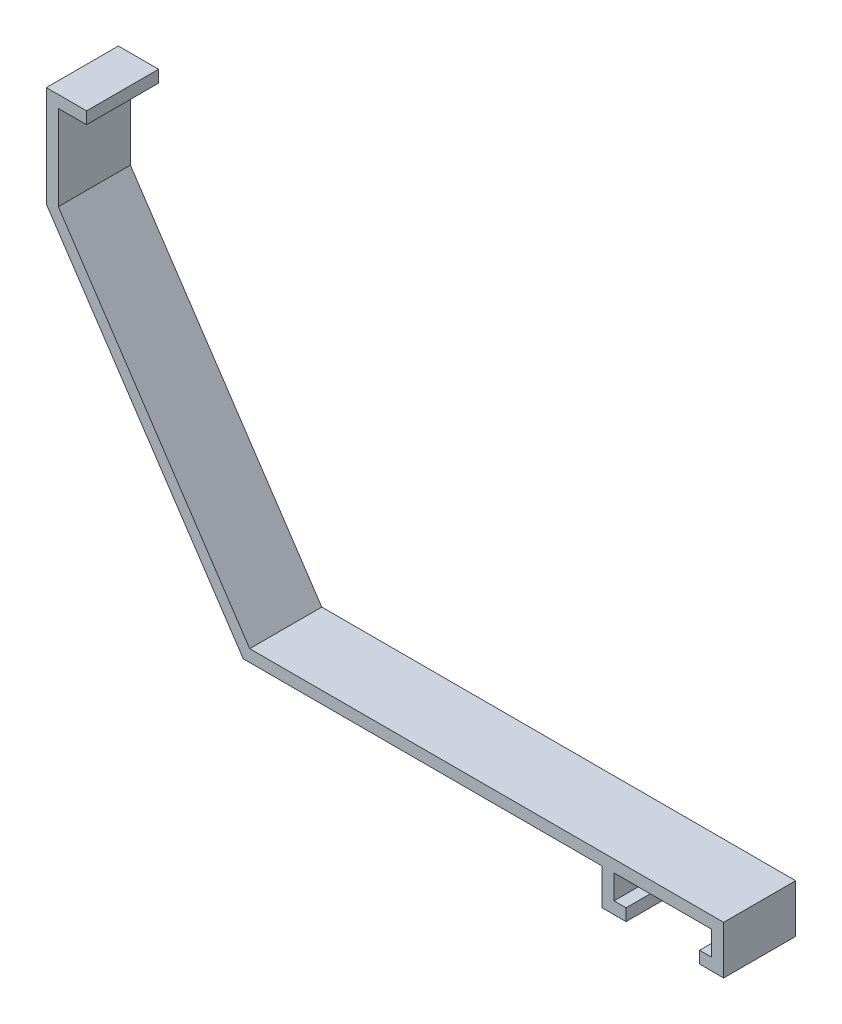
ISO-10303-21;
HEADER;
FILE_DESCRIPTION(('STEP AP214'),'2;1');
FILE_NAME('part.step','',(''),(''),'','','');
FILE_SCHEMA(('AUTOMOTIVE_DESIGN { 1 0 10303 214 1 1 1 1 }'));
ENDSEC;
DATA;
#1=APPLICATION_CONTEXT('core data for automotive mechanical design processes');
#2=APPLICATION_PROTOCOL_DEFINITION('international standard','automotive_design',2000,#1);
#3=PRODUCT_CONTEXT('',#1,'mechanical');
#4=PRODUCT('Part','Part','',(#3));
#5=PRODUCT_RELATED_PRODUCT_CATEGORY('part','',(#4));
#6=PRODUCT_DEFINITION_FORMATION('','',#4);
#7=PRODUCT_DEFINITION_CONTEXT('part definition',#1,'design');
#8=PRODUCT_DEFINITION('design','',#6,#7);
#9=PRODUCT_DEFINITION_SHAPE('','',#8);
#10=(LENGTH_UNIT() NAMED_UNIT(*) SI_UNIT(.MILLI.,.METRE.));
#11=(NAMED_UNIT(*) PLANE_ANGLE_UNIT() SI_UNIT($,.RADIAN.));
#12=(NAMED_UNIT(*) SI_UNIT($,.STERADIAN.) SOLID_ANGLE_UNIT());
#13=UNCERTAINTY_MEASURE_WITH_UNIT(LENGTH_MEASURE(1.E-05),#10,'distance_accuracy_value','');
#14=(GEOMETRIC_REPRESENTATION_CONTEXT(3) GLOBAL_UNCERTAINTY_ASSIGNED_CONTEXT((#13)) GLOBAL_UNIT_ASSIGNED_CONTEXT((#10,
#11,#12)) REPRESENTATION_CONTEXT('',''));
#15=CARTESIAN_POINT('',(0.,0.,0.));
#16=DIRECTION('',(0.,0.,1.));
#17=DIRECTION('',(1.,0.,0.));
#18=AXIS2_PLACEMENT_3D('',#15,#16,#17);
#19=CARTESIAN_POINT('',(0.,-1.5875,9.525));
#20=DIRECTION('',(-1.,0.,0.));
#21=DIRECTION('',(0.,0.,1.));
#22=AXIS2_PLACEMENT_3D('',#19,#20,#21);
#23=PLANE('',#22);
#24=DIRECTION('',(0.,1.,0.));
#25=VECTOR('',#24,1.);
#26=CARTESIAN_POINT('',(0.,-1.5875,0.));
#27=LINE('',#26,#25);
#28=CARTESIAN_POINT('',(0.,-1.5875,0.));
#29=VERTEX_POINT('',#28);
#30=CARTESIAN_POINT('',(0.,0.,0.));
#31=VERTEX_POINT('',#30);
#32=EDGE_CURVE('E203',#29,#31,#27,.T.);
#33=ORIENTED_EDGE('',*,*,#32,.T.);
#34=DIRECTION('',(0.,0.,-1.));
#35=VECTOR('',#34,1.);
#36=CARTESIAN_POINT('',(0.,0.,9.525));
#37=LINE('',#36,#35);
#38=CARTESIAN_POINT('',(0.,0.,9.525));
#39=VERTEX_POINT('',#38);
#40=EDGE_CURVE('E11',#39,#31,#37,.T.);
#41=ORIENTED_EDGE('',*,*,#40,.F.);
#42=DIRECTION('',(0.,1.,0.));
#43=VECTOR('',#42,1.);
#44=CARTESIAN_POINT('',(0.,-1.5875,9.525));
#45=LINE('',#44,#43);
#46=CARTESIAN_POINT('',(0.,-1.5875,9.525));
#47=VERTEX_POINT('',#46);
#48=EDGE_CURVE('E241',#47,#39,#45,.T.);
#49=ORIENTED_EDGE('',*,*,#48,.F.);
#50=DIRECTION('',(0.,0.,-1.));
#51=VECTOR('',#50,1.);
#52=CARTESIAN_POINT('',(0.,-1.5875,9.525));
#53=LINE('',#52,#51);
#54=EDGE_CURVE('E199',#47,#29,#53,.T.);
#55=ORIENTED_EDGE('',*,*,#54,.T.);
#56=EDGE_LOOP('',(#33,#41,#49,#55));
#57=FACE_BOUND('',#56,.T.);
#58=ADVANCED_FACE('F35',(#57),#23,.F.);
#59=CARTESIAN_POINT('',(0.,0.,9.525));
#60=DIRECTION('',(0.,-1.,0.));
#61=DIRECTION('',(1.,0.,0.));
#62=AXIS2_PLACEMENT_3D('',#59,#60,#61);
#63=PLANE('',#62);
#64=DIRECTION('',(-1.,0.,0.));
#65=VECTOR('',#64,1.);
#66=CARTESIAN_POINT('',(0.,0.,0.));
#67=LINE('',#66,#65);
#68=CARTESIAN_POINT('',(-5.3213,0.,0.));
#69=VERTEX_POINT('',#68);
#70=EDGE_CURVE('E206',#31,#69,#67,.T.);
#71=ORIENTED_EDGE('',*,*,#70,.T.);
#72=DIRECTION('',(0.,0.,-1.));
#73=VECTOR('',#72,1.);
#74=CARTESIAN_POINT('',(-5.3213,0.,9.525));
#75=LINE('',#74,#73);
#76=CARTESIAN_POINT('',(-5.3213,0.,9.525));
#77=VERTEX_POINT('',#76);
#78=EDGE_CURVE('E43',#77,#69,#75,.T.);
#79=ORIENTED_EDGE('',*,*,#78,.F.);
#80=DIRECTION('',(-1.,0.,0.));
#81=VECTOR('',#80,1.);
#82=CARTESIAN_POINT('',(0.,0.,9.525));
#83=LINE('',#82,#81);
#84=EDGE_CURVE('E130',#39,#77,#83,.T.);
#85=ORIENTED_EDGE('',*,*,#84,.F.);
#86=ORIENTED_EDGE('',*,*,#40,.T.);
#87=EDGE_LOOP('',(#71,#79,#85,#86));
#88=FACE_BOUND('',#87,.T.);
#89=ADVANCED_FACE('F359',(#88),#63,.F.);
#90=CARTESIAN_POINT('',(-5.3213,0.,9.525));
#91=DIRECTION('',(1.,0.,0.));
#92=DIRECTION('',(0.,1.,0.));
#93=AXIS2_PLACEMENT_3D('',#90,#91,#92);
#94=PLANE('',#93);
#95=DIRECTION('',(0.,-1.,0.));
#96=VECTOR('',#95,1.);
#97=CARTESIAN_POINT('',(-5.3213,0.,0.));
#98=LINE('',#97,#96);
#99=CARTESIAN_POINT('',(-5.3213,-13.3191597256673,0.));
#100=VERTEX_POINT('',#99);
#101=EDGE_CURVE('E208',#69,#100,#98,.T.);
#102=ORIENTED_EDGE('',*,*,#101,.T.);
#103=DIRECTION('',(0.,0.,-1.));
#104=VECTOR('',#103,1.);
#105=CARTESIAN_POINT('',(-5.3213,-13.3191597256673,9.525));
#106=LINE('',#105,#104);
#107=CARTESIAN_POINT('',(-5.3213,-13.3191597256673,9.525));
#108=VERTEX_POINT('',#107);
#109=EDGE_CURVE('E284',#108,#100,#106,.T.);
#110=ORIENTED_EDGE('',*,*,#109,.F.);
#111=DIRECTION('',(0.,-1.,0.));
#112=VECTOR('',#111,1.);
#113=CARTESIAN_POINT('',(-5.3213,0.,9.525));
#114=LINE('',#113,#112);
#115=EDGE_CURVE('E292',#77,#108,#114,.T.);
#116=ORIENTED_EDGE('',*,*,#115,.F.);
#117=ORIENTED_EDGE('',*,*,#78,.T.);
#118=EDGE_LOOP('',(#102,#110,#116,#117));
#119=FACE_BOUND('',#118,.T.);
#120=ADVANCED_FACE('F290',(#119),#94,.F.);
#121=CARTESIAN_POINT('',(-5.3213,-13.3191597256673,9.525));
#122=DIRECTION('',(0.832050948079559,0.554699215611404,0.));
#123=DIRECTION('',(-0.554699215611404,0.832050948079559,0.));
#124=AXIS2_PLACEMENT_3D('',#121,#122,#123);
#125=PLANE('',#124);
#126=DIRECTION('',(0.554699215611404,-0.832050948079559,0.));
#127=VECTOR('',#126,1.);
#128=CARTESIAN_POINT('',(-5.3213,-13.3191597256673,0.));
#129=LINE('',#128,#127);
#130=CARTESIAN_POINT('',(20.7152825744849,-52.3741333152252,0.));
#131=VERTEX_POINT('',#130);
#132=EDGE_CURVE('E210',#100,#131,#129,.T.);
#133=ORIENTED_EDGE('',*,*,#132,.T.);
#134=DIRECTION('',(0.,0.,-1.));
#135=VECTOR('',#134,1.);
#136=CARTESIAN_POINT('',(20.7152825744849,-52.3741333152252,9.525));
#137=LINE('',#136,#135);
#138=CARTESIAN_POINT('',(20.7152825744849,-52.3741333152252,9.525));
#139=VERTEX_POINT('',#138);
#140=EDGE_CURVE('E281',#139,#131,#137,.T.);
#141=ORIENTED_EDGE('',*,*,#140,.F.);
#142=DIRECTION('',(0.554699215611404,-0.832050948079559,0.));
#143=VECTOR('',#142,1.);
#144=CARTESIAN_POINT('',(-5.3213,-13.3191597256673,9.525));
#145=LINE('',#144,#143);
#146=EDGE_CURVE('E310',#108,#139,#145,.T.);
#147=ORIENTED_EDGE('',*,*,#146,.F.);
#148=ORIENTED_EDGE('',*,*,#109,.T.);
#149=EDGE_LOOP('',(#133,#141,#147,#148));
#150=FACE_BOUND('',#149,.T.);
#151=ADVANCED_FACE('F301',(#150),#125,.F.);
#152=CARTESIAN_POINT('',(20.7152825744849,-52.3741333152252,9.525));
#153=DIRECTION('',(0.,1.,0.));
#154=DIRECTION('',(-1.,0.,0.));
#155=AXIS2_PLACEMENT_3D('',#152,#153,#154);
#156=PLANE('',#155);
#157=DIRECTION('',(1.,0.,0.));
#158=VECTOR('',#157,1.);
#159=CARTESIAN_POINT('',(20.7152825744849,-52.3741333152252,0.));
#160=LINE('',#159,#158);
#161=CARTESIAN_POINT('',(68.1402825744848,-52.3741333152252,0.));
#162=VERTEX_POINT('',#161);
#163=EDGE_CURVE('E212',#131,#162,#160,.T.);
#164=ORIENTED_EDGE('',*,*,#163,.T.);
#165=DIRECTION('',(0.,0.,-1.));
#166=VECTOR('',#165,1.);
#167=CARTESIAN_POINT('',(68.1402825744848,-52.3741333152252,9.525));
#168=LINE('',#167,#166);
#169=CARTESIAN_POINT('',(68.1402825744848,-52.3741333152252,9.525));
#170=VERTEX_POINT('',#169);
#171=EDGE_CURVE('E278',#170,#162,#168,.T.);
#172=ORIENTED_EDGE('',*,*,#171,.F.);
#173=DIRECTION('',(1.,0.,0.));
#174=VECTOR('',#173,1.);
#175=CARTESIAN_POINT('',(20.7152825744849,-52.3741333152252,9.525));
#176=LINE('',#175,#174);
#177=EDGE_CURVE('E307',#139,#170,#176,.T.);
#178=ORIENTED_EDGE('',*,*,#177,.F.);
#179=ORIENTED_EDGE('',*,*,#140,.T.);
#180=EDGE_LOOP('',(#164,#172,#178,#179));
#181=FACE_BOUND('',#180,.T.);
#182=ADVANCED_FACE('F305',(#181),#156,.F.);
#183=CARTESIAN_POINT('',(68.1402825744848,-52.3741333152252,9.525));
#184=DIRECTION('',(1.,0.,0.));
#185=DIRECTION('',(0.,1.,0.));
#186=AXIS2_PLACEMENT_3D('',#183,#184,#185);
#187=PLANE('',#186);
#188=DIRECTION('',(0.,-1.,0.));
#189=VECTOR('',#188,1.);
#190=CARTESIAN_POINT('',(68.1402825744848,-52.3741333152252,0.));
#191=LINE('',#190,#189);
#192=CARTESIAN_POINT('',(68.1402825744849,-57.1616333152252,0.));
#193=VERTEX_POINT('',#192);
#194=EDGE_CURVE('E214',#162,#193,#191,.T.);
#195=ORIENTED_EDGE('',*,*,#194,.T.);
#196=DIRECTION('',(0.,0.,-1.));
#197=VECTOR('',#196,1.);
#198=CARTESIAN_POINT('',(68.1402825744849,-57.1616333152252,9.525));
#199=LINE('',#198,#197);
#200=CARTESIAN_POINT('',(68.1402825744849,-57.1616333152252,9.525));
#201=VERTEX_POINT('',#200);
#202=EDGE_CURVE('E275',#201,#193,#199,.T.);
#203=ORIENTED_EDGE('',*,*,#202,.F.);
#204=DIRECTION('',(0.,-1.,0.));
#205=VECTOR('',#204,1.);
#206=CARTESIAN_POINT('',(68.1402825744848,-52.3741333152252,9.525));
#207=LINE('',#206,#205);
#208=EDGE_CURVE('E309',#170,#201,#207,.T.);
#209=ORIENTED_EDGE('',*,*,#208,.F.);
#210=ORIENTED_EDGE('',*,*,#171,.T.);
#211=EDGE_LOOP('',(#195,#203,#209,#210));
#212=FACE_BOUND('',#211,.T.);
#213=ADVANCED_FACE('F372',(#212),#187,.F.);
#214=CARTESIAN_POINT('',(68.1402825744849,-57.1616333152252,9.525));
#215=DIRECTION('',(0.,1.,0.));
#216=DIRECTION('',(0.,0.,1.));
#217=AXIS2_PLACEMENT_3D('',#214,#215,#216);
#218=PLANE('',#217);
#219=DIRECTION('',(1.,0.,0.));
#220=VECTOR('',#219,1.);
#221=CARTESIAN_POINT('',(68.1402825744849,-57.1616333152252,0.));
#222=LINE('',#221,#220);
#223=CARTESIAN_POINT('',(71.3152825744849,-57.1616333152252,0.));
#224=VERTEX_POINT('',#223);
#225=EDGE_CURVE('E216',#193,#224,#222,.T.);
#226=ORIENTED_EDGE('',*,*,#225,.T.);
#227=DIRECTION('',(0.,0.,-1.));
#228=VECTOR('',#227,1.);
#229=CARTESIAN_POINT('',(71.3152825744849,-57.1616333152252,9.525));
#230=LINE('',#229,#228);
#231=CARTESIAN_POINT('',(71.3152825744849,-57.1616333152252,9.525));
#232=VERTEX_POINT('',#231);
#233=EDGE_CURVE('E272',#232,#224,#230,.T.);
#234=ORIENTED_EDGE('',*,*,#233,.F.);
#235=DIRECTION('',(1.,0.,0.));
#236=VECTOR('',#235,1.);
#237=CARTESIAN_POINT('',(68.1402825744849,-57.1616333152252,9.525));
#238=LINE('',#237,#236);
#239=EDGE_CURVE('E312',#201,#232,#238,.T.);
#240=ORIENTED_EDGE('',*,*,#239,.F.);
#241=ORIENTED_EDGE('',*,*,#202,.T.);
#242=EDGE_LOOP('',(#226,#234,#240,#241));
#243=FACE_BOUND('',#242,.T.);
#244=ADVANCED_FACE('F375',(#243),#218,.F.);
#245=CARTESIAN_POINT('',(71.3152825744849,-57.1616333152252,9.525));
#246=DIRECTION('',(-1.,0.,0.));
#247=DIRECTION('',(0.,0.,1.));
#248=AXIS2_PLACEMENT_3D('',#245,#246,#247);
#249=PLANE('',#248);
#250=DIRECTION('',(0.,1.,0.));
#251=VECTOR('',#250,1.);
#252=CARTESIAN_POINT('',(71.3152825744849,-57.1616333152252,0.));
#253=LINE('',#252,#251);
#254=CARTESIAN_POINT('',(71.3152825744849,-55.5741333152252,0.));
#255=VERTEX_POINT('',#254);
#256=EDGE_CURVE('E218',#224,#255,#253,.T.);
#257=ORIENTED_EDGE('',*,*,#256,.T.);
#258=DIRECTION('',(0.,0.,-1.));
#259=VECTOR('',#258,1.);
#260=CARTESIAN_POINT('',(71.3152825744849,-55.5741333152252,9.525));
#261=LINE('',#260,#259);
#262=CARTESIAN_POINT('',(71.3152825744849,-55.5741333152252,9.525));
#263=VERTEX_POINT('',#262);
#264=EDGE_CURVE('E269',#263,#255,#261,.T.);
#265=ORIENTED_EDGE('',*,*,#264,.F.);
#266=DIRECTION('',(0.,1.,0.));
#267=VECTOR('',#266,1.);
#268=CARTESIAN_POINT('',(71.3152825744849,-57.1616333152252,9.525));
#269=LINE('',#268,#267);
#270=EDGE_CURVE('E318',#232,#263,#269,.T.);
#271=ORIENTED_EDGE('',*,*,#270,.F.);
#272=ORIENTED_EDGE('',*,*,#233,.T.);
#273=EDGE_LOOP('',(#257,#265,#271,#272));
#274=FACE_BOUND('',#273,.T.);
#275=ADVANCED_FACE('F379',(#274),#249,.F.);
#276=CARTESIAN_POINT('',(71.3152825744849,-55.5741333152252,9.525));
#277=DIRECTION('',(0.,-1.,0.));
#278=DIRECTION('',(0.,0.,-1.));
#279=AXIS2_PLACEMENT_3D('',#276,#277,#278);
#280=PLANE('',#279);
#281=DIRECTION('',(-1.,0.,0.));
#282=VECTOR('',#281,1.);
#283=CARTESIAN_POINT('',(71.3152825744849,-55.5741333152252,0.));
#284=LINE('',#283,#282);
#285=CARTESIAN_POINT('',(69.7277825744849,-55.5741333152252,0.));
#286=VERTEX_POINT('',#285);
#287=EDGE_CURVE('E220',#255,#286,#284,.T.);
#288=ORIENTED_EDGE('',*,*,#287,.T.);
#289=DIRECTION('',(0.,0.,-1.));
#290=VECTOR('',#289,1.);
#291=CARTESIAN_POINT('',(69.7277825744849,-55.5741333152252,9.525));
#292=LINE('',#291,#290);
#293=CARTESIAN_POINT('',(69.7277825744849,-55.5741333152252,9.525));
#294=VERTEX_POINT('',#293);
#295=EDGE_CURVE('E266',#294,#286,#292,.T.);
#296=ORIENTED_EDGE('',*,*,#295,.F.);
#297=DIRECTION('',(-1.,0.,0.));
#298=VECTOR('',#297,1.);
#299=CARTESIAN_POINT('',(71.3152825744849,-55.5741333152252,9.525));
#300=LINE('',#299,#298);
#301=EDGE_CURVE('E320',#263,#294,#300,.T.);
#302=ORIENTED_EDGE('',*,*,#301,.F.);
#303=ORIENTED_EDGE('',*,*,#264,.T.);
#304=EDGE_LOOP('',(#288,#296,#302,#303));
#305=FACE_BOUND('',#304,.T.);
#306=ADVANCED_FACE('F383',(#305),#280,.F.);
#307=CARTESIAN_POINT('',(69.7277825744849,-55.5741333152252,9.525));
#308=DIRECTION('',(-1.,0.,0.));
#309=DIRECTION('',(0.,0.,1.));
#310=AXIS2_PLACEMENT_3D('',#307,#308,#309);
#311=PLANE('',#310);
#312=DIRECTION('',(0.,1.,0.));
#313=VECTOR('',#312,1.);
#314=CARTESIAN_POINT('',(69.7277825744849,-55.5741333152252,0.));
#315=LINE('',#314,#313);
#316=CARTESIAN_POINT('',(69.7277825744849,-52.3741333152252,0.));
#317=VERTEX_POINT('',#316);
#318=EDGE_CURVE('E222',#286,#317,#315,.T.);
#319=ORIENTED_EDGE('',*,*,#318,.T.);
#320=DIRECTION('',(0.,0.,-1.));
#321=VECTOR('',#320,1.);
#322=CARTESIAN_POINT('',(69.7277825744849,-52.3741333152252,9.525));
#323=LINE('',#322,#321);
#324=CARTESIAN_POINT('',(69.7277825744849,-52.3741333152252,9.525));
#325=VERTEX_POINT('',#324);
#326=EDGE_CURVE('E263',#325,#317,#323,.T.);
#327=ORIENTED_EDGE('',*,*,#326,.F.);
#328=DIRECTION('',(0.,1.,0.));
#329=VECTOR('',#328,1.);
#330=CARTESIAN_POINT('',(69.7277825744849,-55.5741333152252,9.525));
#331=LINE('',#330,#329);
#332=EDGE_CURVE('E322',#294,#325,#331,.T.);
#333=ORIENTED_EDGE('',*,*,#332,.F.);
#334=ORIENTED_EDGE('',*,*,#295,.T.);
#335=EDGE_LOOP('',(#319,#327,#333,#334));
#336=FACE_BOUND('',#335,.T.);
#337=ADVANCED_FACE('F387',(#336),#311,.F.);
#338=CARTESIAN_POINT('',(69.7277825744849,-52.3741333152252,9.525));
#339=DIRECTION('',(0.,1.,0.));
#340=DIRECTION('',(-1.,0.,0.));
#341=AXIS2_PLACEMENT_3D('',#338,#339,#340);
#342=PLANE('',#341);
#343=DIRECTION('',(1.,0.,0.));
#344=VECTOR('',#343,1.);
#345=CARTESIAN_POINT('',(69.7277825744849,-52.3741333152252,0.));
#346=LINE('',#345,#344);
#347=CARTESIAN_POINT('',(82.6277825744848,-52.3741333152252,0.));
#348=VERTEX_POINT('',#347);
#349=EDGE_CURVE('E224',#317,#348,#346,.T.);
#350=ORIENTED_EDGE('',*,*,#349,.T.);
#351=DIRECTION('',(0.,0.,-1.));
#352=VECTOR('',#351,1.);
#353=CARTESIAN_POINT('',(82.6277825744848,-52.3741333152252,9.525));
#354=LINE('',#353,#352);
#355=CARTESIAN_POINT('',(82.6277825744848,-52.3741333152252,9.525));
#356=VERTEX_POINT('',#355);
#357=EDGE_CURVE('E260',#356,#348,#354,.T.);
#358=ORIENTED_EDGE('',*,*,#357,.F.);
#359=DIRECTION('',(1.,0.,0.));
#360=VECTOR('',#359,1.);
#361=CARTESIAN_POINT('',(69.7277825744849,-52.3741333152252,9.525));
#362=LINE('',#361,#360);
#363=EDGE_CURVE('E324',#325,#356,#362,.T.);
#364=ORIENTED_EDGE('',*,*,#363,.F.);
#365=ORIENTED_EDGE('',*,*,#326,.T.);
#366=EDGE_LOOP('',(#350,#358,#364,#365));
#367=FACE_BOUND('',#366,.T.);
#368=ADVANCED_FACE('F391',(#367),#342,.F.);
#369=CARTESIAN_POINT('',(82.6277825744848,-52.3741333152252,9.525));
#370=DIRECTION('',(1.,0.,0.));
#371=DIRECTION('',(0.,1.,0.));
#372=AXIS2_PLACEMENT_3D('',#369,#370,#371);
#373=PLANE('',#372);
#374=DIRECTION('',(0.,-1.,0.));
#375=VECTOR('',#374,1.);
#376=CARTESIAN_POINT('',(82.6277825744848,-52.3741333152252,0.));
#377=LINE('',#376,#375);
#378=CARTESIAN_POINT('',(82.6277825744849,-55.5741333152252,0.));
#379=VERTEX_POINT('',#378);
#380=EDGE_CURVE('E226',#348,#379,#377,.T.);
#381=ORIENTED_EDGE('',*,*,#380,.T.);
#382=DIRECTION('',(0.,0.,-1.));
#383=VECTOR('',#382,1.);
#384=CARTESIAN_POINT('',(82.6277825744849,-55.5741333152252,9.525));
#385=LINE('',#384,#383);
#386=CARTESIAN_POINT('',(82.6277825744849,-55.5741333152252,9.525));
#387=VERTEX_POINT('',#386);
#388=EDGE_CURVE('E257',#387,#379,#385,.T.);
#389=ORIENTED_EDGE('',*,*,#388,.F.);
#390=DIRECTION('',(0.,-1.,0.));
#391=VECTOR('',#390,1.);
#392=CARTESIAN_POINT('',(82.6277825744848,-52.3741333152252,9.525));
#393=LINE('',#392,#391);
#394=EDGE_CURVE('E326',#356,#387,#393,.T.);
#395=ORIENTED_EDGE('',*,*,#394,.F.);
#396=ORIENTED_EDGE('',*,*,#357,.T.);
#397=EDGE_LOOP('',(#381,#389,#395,#396));
#398=FACE_BOUND('',#397,.T.);
#399=ADVANCED_FACE('F395',(#398),#373,.F.);
#400=CARTESIAN_POINT('',(82.6277825744849,-55.5741333152252,9.525));
#401=DIRECTION('',(0.,-1.,0.));
#402=DIRECTION('',(1.,0.,0.));
#403=AXIS2_PLACEMENT_3D('',#400,#401,#402);
#404=PLANE('',#403);
#405=DIRECTION('',(-1.,0.,0.));
#406=VECTOR('',#405,1.);
#407=CARTESIAN_POINT('',(82.6277825744849,-55.5741333152252,0.));
#408=LINE('',#407,#406);
#409=CARTESIAN_POINT('',(81.0402825744849,-55.5741333152252,0.));
#410=VERTEX_POINT('',#409);
#411=EDGE_CURVE('E228',#379,#410,#408,.T.);
#412=ORIENTED_EDGE('',*,*,#411,.T.);
#413=DIRECTION('',(0.,0.,-1.));
#414=VECTOR('',#413,1.);
#415=CARTESIAN_POINT('',(81.0402825744849,-55.5741333152252,9.525));
#416=LINE('',#415,#414);
#417=CARTESIAN_POINT('',(81.0402825744849,-55.5741333152252,9.525));
#418=VERTEX_POINT('',#417);
#419=EDGE_CURVE('E254',#418,#410,#416,.T.);
#420=ORIENTED_EDGE('',*,*,#419,.F.);
#421=DIRECTION('',(-1.,0.,0.));
#422=VECTOR('',#421,1.);
#423=CARTESIAN_POINT('',(82.6277825744849,-55.5741333152252,9.525));
#424=LINE('',#423,#422);
#425=EDGE_CURVE('E328',#387,#418,#424,.T.);
#426=ORIENTED_EDGE('',*,*,#425,.F.);
#427=ORIENTED_EDGE('',*,*,#388,.T.);
#428=EDGE_LOOP('',(#412,#420,#426,#427));
#429=FACE_BOUND('',#428,.T.);
#430=ADVANCED_FACE('F399',(#429),#404,.F.);
#431=CARTESIAN_POINT('',(81.0402825744849,-55.5741333152252,9.525));
#432=DIRECTION('',(1.,0.,0.));
#433=DIRECTION('',(0.,0.,-1.));
#434=AXIS2_PLACEMENT_3D('',#431,#432,#433);
#435=PLANE('',#434);
#436=DIRECTION('',(0.,-1.,0.));
#437=VECTOR('',#436,1.);
#438=CARTESIAN_POINT('',(81.0402825744849,-55.5741333152252,0.));
#439=LINE('',#438,#437);
#440=CARTESIAN_POINT('',(81.0402825744849,-57.1616333152252,0.));
#441=VERTEX_POINT('',#440);
#442=EDGE_CURVE('E230',#410,#441,#439,.T.);
#443=ORIENTED_EDGE('',*,*,#442,.T.);
#444=DIRECTION('',(0.,0.,-1.));
#445=VECTOR('',#444,1.);
#446=CARTESIAN_POINT('',(81.0402825744849,-57.1616333152252,9.525));
#447=LINE('',#446,#445);
#448=CARTESIAN_POINT('',(81.0402825744849,-57.1616333152252,9.525));
#449=VERTEX_POINT('',#448);
#450=EDGE_CURVE('E251',#449,#441,#447,.T.);
#451=ORIENTED_EDGE('',*,*,#450,.F.);
#452=DIRECTION('',(0.,-1.,0.));
#453=VECTOR('',#452,1.);
#454=CARTESIAN_POINT('',(81.0402825744849,-55.5741333152252,9.525));
#455=LINE('',#454,#453);
#456=EDGE_CURVE('E330',#418,#449,#455,.T.);
#457=ORIENTED_EDGE('',*,*,#456,.F.);
#458=ORIENTED_EDGE('',*,*,#419,.T.);
#459=EDGE_LOOP('',(#443,#451,#457,#458));
#460=FACE_BOUND('',#459,.T.);
#461=ADVANCED_FACE('F403',(#460),#435,.F.);
#462=CARTESIAN_POINT('',(81.0402825744849,-57.1616333152252,9.525));
#463=DIRECTION('',(0.,1.,0.));
#464=DIRECTION('',(0.,0.,1.));
#465=AXIS2_PLACEMENT_3D('',#462,#463,#464);
#466=PLANE('',#465);
#467=DIRECTION('',(1.,0.,0.));
#468=VECTOR('',#467,1.);
#469=CARTESIAN_POINT('',(81.0402825744849,-57.1616333152252,0.));
#470=LINE('',#469,#468);
#471=CARTESIAN_POINT('',(84.2152825744849,-57.1616333152252,0.));
#472=VERTEX_POINT('',#471);
#473=EDGE_CURVE('E232',#441,#472,#470,.T.);
#474=ORIENTED_EDGE('',*,*,#473,.T.);
#475=DIRECTION('',(0.,0.,-1.));
#476=VECTOR('',#475,1.);
#477=CARTESIAN_POINT('',(84.2152825744849,-57.1616333152252,9.525));
#478=LINE('',#477,#476);
#479=CARTESIAN_POINT('',(84.2152825744849,-57.1616333152252,9.525));
#480=VERTEX_POINT('',#479);
#481=EDGE_CURVE('E248',#480,#472,#478,.T.);
#482=ORIENTED_EDGE('',*,*,#481,.F.);
#483=DIRECTION('',(1.,0.,0.));
#484=VECTOR('',#483,1.);
#485=CARTESIAN_POINT('',(81.0402825744849,-57.1616333152252,9.525));
#486=LINE('',#485,#484);
#487=EDGE_CURVE('E332',#449,#480,#486,.T.);
#488=ORIENTED_EDGE('',*,*,#487,.F.);
#489=ORIENTED_EDGE('',*,*,#450,.T.);
#490=EDGE_LOOP('',(#474,#482,#488,#489));
#491=FACE_BOUND('',#490,.T.);
#492=ADVANCED_FACE('F407',(#491),#466,.F.);
#493=CARTESIAN_POINT('',(84.2152825744849,-57.1616333152252,9.525));
#494=DIRECTION('',(-1.,0.,0.));
#495=DIRECTION('',(0.,-1.,0.));
#496=AXIS2_PLACEMENT_3D('',#493,#494,#495);
#497=PLANE('',#496);
#498=DIRECTION('',(0.,1.,0.));
#499=VECTOR('',#498,1.);
#500=CARTESIAN_POINT('',(84.2152825744849,-57.1616333152252,0.));
#501=LINE('',#500,#499);
#502=CARTESIAN_POINT('',(84.2152825744848,-50.7866333152252,0.));
#503=VERTEX_POINT('',#502);
#504=EDGE_CURVE('E234',#472,#503,#501,.T.);
#505=ORIENTED_EDGE('',*,*,#504,.T.);
#506=DIRECTION('',(0.,0.,-1.));
#507=VECTOR('',#506,1.);
#508=CARTESIAN_POINT('',(84.2152825744848,-50.7866333152252,9.525));
#509=LINE('',#508,#507);
#510=CARTESIAN_POINT('',(84.2152825744848,-50.7866333152252,9.525));
#511=VERTEX_POINT('',#510);
#512=EDGE_CURVE('E245',#511,#503,#509,.T.);
#513=ORIENTED_EDGE('',*,*,#512,.F.);
#514=DIRECTION('',(0.,1.,0.));
#515=VECTOR('',#514,1.);
#516=CARTESIAN_POINT('',(84.2152825744849,-57.1616333152252,9.525));
#517=LINE('',#516,#515);
#518=EDGE_CURVE('E334',#480,#511,#517,.T.);
#519=ORIENTED_EDGE('',*,*,#518,.F.);
#520=ORIENTED_EDGE('',*,*,#481,.T.);
#521=EDGE_LOOP('',(#505,#513,#519,#520));
#522=FACE_BOUND('',#521,.T.);
#523=ADVANCED_FACE('F340',(#522),#497,.F.);
#524=CARTESIAN_POINT('',(84.2152825744848,-50.7866333152252,9.525));
#525=DIRECTION('',(0.,-1.,0.));
#526=DIRECTION('',(1.,0.,0.));
#527=AXIS2_PLACEMENT_3D('',#524,#525,#526);
#528=PLANE('',#527);
#529=DIRECTION('',(-1.,0.,0.));
#530=VECTOR('',#529,1.);
#531=CARTESIAN_POINT('',(84.2152825744848,-50.7866333152252,0.));
#532=LINE('',#531,#530);
#533=CARTESIAN_POINT('',(21.5648879944997,-50.7866333152252,0.));
#534=VERTEX_POINT('',#533);
#535=EDGE_CURVE('E236',#503,#534,#532,.T.);
#536=ORIENTED_EDGE('',*,*,#535,.T.);
#537=DIRECTION('',(0.,0.,-1.));
#538=VECTOR('',#537,1.);
#539=CARTESIAN_POINT('',(21.5648879944997,-50.7866333152252,9.525));
#540=LINE('',#539,#538);
#541=CARTESIAN_POINT('',(21.5648879944997,-50.7866333152252,9.525));
#542=VERTEX_POINT('',#541);
#543=EDGE_CURVE('E194',#542,#534,#540,.T.);
#544=ORIENTED_EDGE('',*,*,#543,.F.);
#545=DIRECTION('',(-1.,0.,0.));
#546=VECTOR('',#545,1.);
#547=CARTESIAN_POINT('',(84.2152825744848,-50.7866333152252,9.525));
#548=LINE('',#547,#546);
#549=EDGE_CURVE('E185',#511,#542,#548,.T.);
#550=ORIENTED_EDGE('',*,*,#549,.F.);
#551=ORIENTED_EDGE('',*,*,#512,.T.);
#552=EDGE_LOOP('',(#536,#544,#550,#551));
#553=FACE_BOUND('',#552,.T.);
#554=ADVANCED_FACE('F344',(#553),#528,.F.);
#555=CARTESIAN_POINT('',(21.5648879944997,-50.7866333152252,9.525));
#556=DIRECTION('',(-0.832050948079559,-0.554699215611403,0.));
#557=DIRECTION('',(0.554699215611404,-0.83205094807956,0.));
#558=AXIS2_PLACEMENT_3D('',#555,#556,#557);
#559=PLANE('',#558);
#560=DIRECTION('',(-0.554699215611404,0.832050948079559,0.));
#561=VECTOR('',#560,1.);
#562=CARTESIAN_POINT('',(21.5648879944997,-50.7866333152252,0.));
#563=LINE('',#562,#561);
#564=CARTESIAN_POINT('',(-3.7338,-12.838504422,0.));
#565=VERTEX_POINT('',#564);
#566=EDGE_CURVE('E193',#534,#565,#563,.T.);
#567=ORIENTED_EDGE('',*,*,#566,.T.);
#568=DIRECTION('',(0.,0.,-1.));
#569=VECTOR('',#568,1.);
#570=CARTESIAN_POINT('',(-3.7338,-12.838504422,9.525));
#571=LINE('',#570,#569);
#572=CARTESIAN_POINT('',(-3.7338,-12.838504422,9.525));
#573=VERTEX_POINT('',#572);
#574=EDGE_CURVE('E190',#573,#565,#571,.T.);
#575=ORIENTED_EDGE('',*,*,#574,.F.);
#576=DIRECTION('',(-0.554699215611404,0.832050948079559,0.));
#577=VECTOR('',#576,1.);
#578=CARTESIAN_POINT('',(21.5648879944997,-50.7866333152252,9.525));
#579=LINE('',#578,#577);
#580=EDGE_CURVE('E179',#542,#573,#579,.T.);
#581=ORIENTED_EDGE('',*,*,#580,.F.);
#582=ORIENTED_EDGE('',*,*,#543,.T.);
#583=EDGE_LOOP('',(#567,#575,#581,#582));
#584=FACE_BOUND('',#583,.T.);
#585=ADVANCED_FACE('F191',(#584),#559,.F.);
#586=CARTESIAN_POINT('',(-3.7338,-12.838504422,9.525));
#587=DIRECTION('',(-1.,0.,0.));
#588=DIRECTION('',(0.,0.,1.));
#589=AXIS2_PLACEMENT_3D('',#586,#587,#588);
#590=PLANE('',#589);
#591=DIRECTION('',(0.,1.,0.));
#592=VECTOR('',#591,1.);
#593=CARTESIAN_POINT('',(-3.7338,-12.838504422,0.));
#594=LINE('',#593,#592);
#595=CARTESIAN_POINT('',(-3.7338,-1.5875,0.));
#596=VERTEX_POINT('',#595);
#597=EDGE_CURVE('E116',#565,#596,#594,.T.);
#598=ORIENTED_EDGE('',*,*,#597,.T.);
#599=DIRECTION('',(0.,0.,-1.));
#600=VECTOR('',#599,1.);
#601=CARTESIAN_POINT('',(-3.7338,-1.5875,9.525));
#602=LINE('',#601,#600);
#603=CARTESIAN_POINT('',(-3.7338,-1.5875,9.525));
#604=VERTEX_POINT('',#603);
#605=EDGE_CURVE('E195',#604,#596,#602,.T.);
#606=ORIENTED_EDGE('',*,*,#605,.F.);
#607=DIRECTION('',(0.,1.,0.));
#608=VECTOR('',#607,1.);
#609=CARTESIAN_POINT('',(-3.7338,-12.838504422,9.525));
#610=LINE('',#609,#608);
#611=EDGE_CURVE('E183',#573,#604,#610,.T.);
#612=ORIENTED_EDGE('',*,*,#611,.F.);
#613=ORIENTED_EDGE('',*,*,#574,.T.);
#614=EDGE_LOOP('',(#598,#606,#612,#613));
#615=FACE_BOUND('',#614,.T.);
#616=ADVANCED_FACE('F197',(#615),#590,.F.);
#617=CARTESIAN_POINT('',(-3.7338,-1.5875,9.525));
#618=DIRECTION('',(0.,1.,0.));
#619=DIRECTION('',(0.,0.,1.));
#620=AXIS2_PLACEMENT_3D('',#617,#618,#619);
#621=PLANE('',#620);
#622=DIRECTION('',(1.,0.,0.));
#623=VECTOR('',#622,1.);
#624=CARTESIAN_POINT('',(-3.7338,-1.5875,0.));
#625=LINE('',#624,#623);
#626=EDGE_CURVE('E122',#596,#29,#625,.T.);
#627=ORIENTED_EDGE('',*,*,#626,.T.);
#628=ORIENTED_EDGE('',*,*,#54,.F.);
#629=DIRECTION('',(1.,0.,0.));
#630=VECTOR('',#629,1.);
#631=CARTESIAN_POINT('',(-3.7338,-1.5875,9.525));
#632=LINE('',#631,#630);
#633=EDGE_CURVE('E51',#604,#47,#632,.T.);
#634=ORIENTED_EDGE('',*,*,#633,.F.);
#635=ORIENTED_EDGE('',*,*,#605,.T.);
#636=EDGE_LOOP('',(#627,#628,#634,#635));
#637=FACE_BOUND('',#636,.T.);
#638=ADVANCED_FACE('F348',(#637),#621,.F.);
#639=CARTESIAN_POINT('',(0.,0.,9.525));
#640=DIRECTION('',(0.,0.,1.));
#641=DIRECTION('',(1.,0.,0.));
#642=AXIS2_PLACEMENT_3D('',#639,#640,#641);
#643=PLANE('',#642);
#644=ORIENTED_EDGE('',*,*,#48,.T.);
#645=ORIENTED_EDGE('',*,*,#84,.T.);
#646=ORIENTED_EDGE('',*,*,#115,.T.);
#647=ORIENTED_EDGE('',*,*,#146,.T.);
#648=ORIENTED_EDGE('',*,*,#177,.T.);
#649=ORIENTED_EDGE('',*,*,#208,.T.);
#650=ORIENTED_EDGE('',*,*,#239,.T.);
#651=ORIENTED_EDGE('',*,*,#270,.T.);
#652=ORIENTED_EDGE('',*,*,#301,.T.);
#653=ORIENTED_EDGE('',*,*,#332,.T.);
#654=ORIENTED_EDGE('',*,*,#363,.T.);
#655=ORIENTED_EDGE('',*,*,#394,.T.);
#656=ORIENTED_EDGE('',*,*,#425,.T.);
#657=ORIENTED_EDGE('',*,*,#456,.T.);
#658=ORIENTED_EDGE('',*,*,#487,.T.);
#659=ORIENTED_EDGE('',*,*,#518,.T.);
#660=ORIENTED_EDGE('',*,*,#549,.T.);
#661=ORIENTED_EDGE('',*,*,#580,.T.);
#662=ORIENTED_EDGE('',*,*,#611,.T.);
#663=ORIENTED_EDGE('',*,*,#633,.T.);
#664=EDGE_LOOP('',(#644,#645,#646,#647,#648,#649,#650,#651,#652,#653,#654,#655,#656,#657,#658,
#659,#660,#661,#662,#663));
#665=FACE_BOUND('',#664,.T.);
#666=ADVANCED_FACE('F181',(#665),#643,.T.);
#667=CARTESIAN_POINT('',(0.,0.,0.));
#668=DIRECTION('',(0.,0.,1.));
#669=DIRECTION('',(1.,0.,0.));
#670=AXIS2_PLACEMENT_3D('',#667,#668,#669);
#671=PLANE('',#670);
#672=ORIENTED_EDGE('',*,*,#32,.F.);
#673=ORIENTED_EDGE('',*,*,#626,.F.);
#674=ORIENTED_EDGE('',*,*,#597,.F.);
#675=ORIENTED_EDGE('',*,*,#566,.F.);
#676=ORIENTED_EDGE('',*,*,#535,.F.);
#677=ORIENTED_EDGE('',*,*,#504,.F.);
#678=ORIENTED_EDGE('',*,*,#473,.F.);
#679=ORIENTED_EDGE('',*,*,#442,.F.);
#680=ORIENTED_EDGE('',*,*,#411,.F.);
#681=ORIENTED_EDGE('',*,*,#380,.F.);
#682=ORIENTED_EDGE('',*,*,#349,.F.);
#683=ORIENTED_EDGE('',*,*,#318,.F.);
#684=ORIENTED_EDGE('',*,*,#287,.F.);
#685=ORIENTED_EDGE('',*,*,#256,.F.);
#686=ORIENTED_EDGE('',*,*,#225,.F.);
#687=ORIENTED_EDGE('',*,*,#194,.F.);
#688=ORIENTED_EDGE('',*,*,#163,.F.);
#689=ORIENTED_EDGE('',*,*,#132,.F.);
#690=ORIENTED_EDGE('',*,*,#101,.F.);
#691=ORIENTED_EDGE('',*,*,#70,.F.);
#692=EDGE_LOOP('',(#672,#673,#674,#675,#676,#677,#678,#679,#680,#681,#682,#683,#684,#685,#686,
#687,#688,#689,#690,#691));
#693=FACE_BOUND('',#692,.T.);
#694=ADVANCED_FACE('F296',(#693),#671,.F.);
#695=CLOSED_SHELL('',(#58,#89,#120,#151,#182,#213,#244,#275,#306,#337,#368,#399,#430,#461,#492,
#523,#554,#585,#616,#638,#666,#694));
#696=MANIFOLD_SOLID_BREP('B2',#695);
#697=ADVANCED_BREP_SHAPE_REPRESENTATION('',(#18,#696),#14);
#698=SHAPE_DEFINITION_REPRESENTATION(#9,#697);
ENDSEC;
END-ISO-10303-21;
